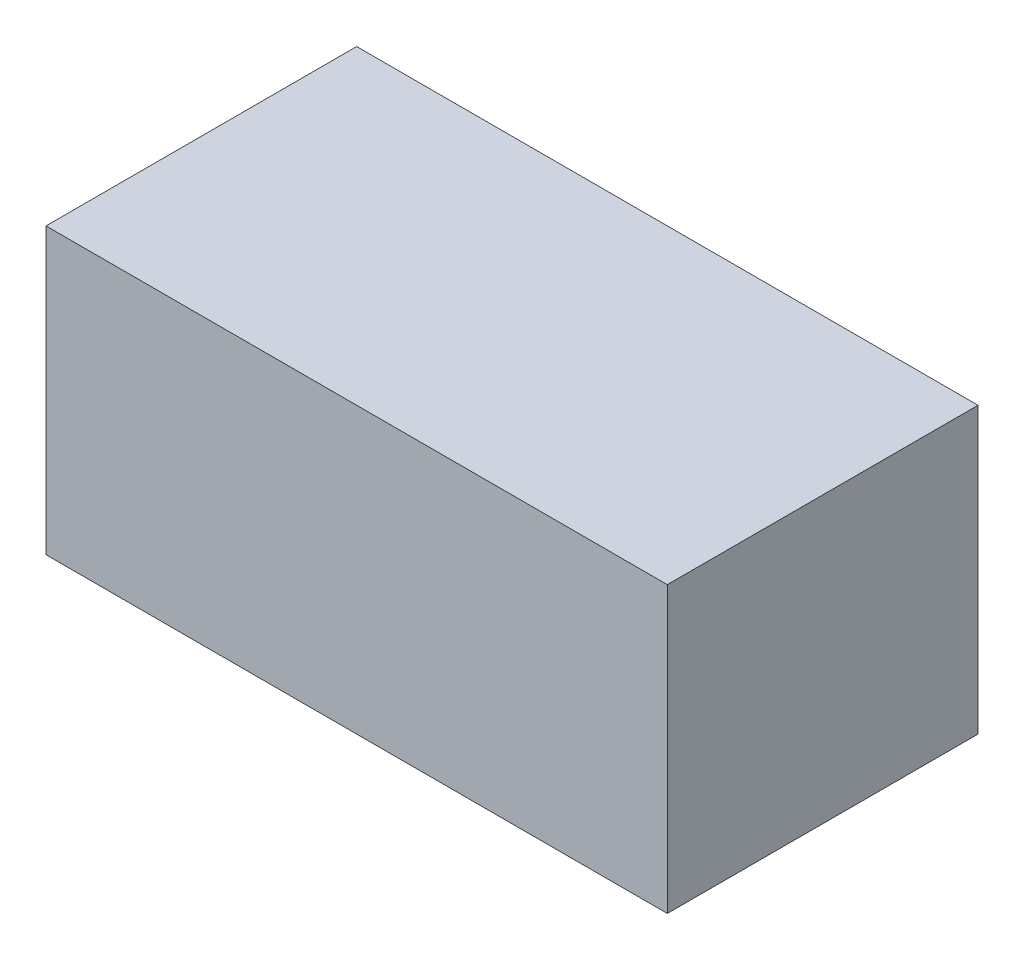
ISO-10303-21;
HEADER;
FILE_DESCRIPTION(('STEP AP214'),'2;1');
FILE_NAME('part.step','',(''),(''),'','','');
FILE_SCHEMA(('AUTOMOTIVE_DESIGN { 1 0 10303 214 1 1 1 1 }'));
ENDSEC;
DATA;
#1=APPLICATION_CONTEXT('core data for automotive mechanical design processes');
#2=APPLICATION_PROTOCOL_DEFINITION('international standard','automotive_design',2000,#1);
#3=PRODUCT_CONTEXT('',#1,'mechanical');
#4=PRODUCT('Part','Part','',(#3));
#5=PRODUCT_RELATED_PRODUCT_CATEGORY('part','',(#4));
#6=PRODUCT_DEFINITION_FORMATION('','',#4);
#7=PRODUCT_DEFINITION_CONTEXT('part definition',#1,'design');
#8=PRODUCT_DEFINITION('design','',#6,#7);
#9=PRODUCT_DEFINITION_SHAPE('','',#8);
#10=(LENGTH_UNIT() NAMED_UNIT(*) SI_UNIT(.MILLI.,.METRE.));
#11=(NAMED_UNIT(*) PLANE_ANGLE_UNIT() SI_UNIT($,.RADIAN.));
#12=(NAMED_UNIT(*) SI_UNIT($,.STERADIAN.) SOLID_ANGLE_UNIT());
#13=UNCERTAINTY_MEASURE_WITH_UNIT(LENGTH_MEASURE(1.E-05),#10,'distance_accuracy_value','');
#14=(GEOMETRIC_REPRESENTATION_CONTEXT(3) GLOBAL_UNCERTAINTY_ASSIGNED_CONTEXT((#13)) GLOBAL_UNIT_ASSIGNED_CONTEXT((#10,
#11,#12)) REPRESENTATION_CONTEXT('',''));
#15=CARTESIAN_POINT('',(0.,0.,0.));
#16=DIRECTION('',(0.,0.,1.));
#17=DIRECTION('',(1.,0.,0.));
#18=AXIS2_PLACEMENT_3D('',#15,#16,#17);
#19=CARTESIAN_POINT('',(-60.,27.5,60.));
#20=DIRECTION('',(1.,0.,0.));
#21=DIRECTION('',(0.,0.,-1.));
#22=AXIS2_PLACEMENT_3D('',#19,#20,#21);
#23=PLANE('',#22);
#24=DIRECTION('',(0.,-1.,0.));
#25=VECTOR('',#24,1.);
#26=CARTESIAN_POINT('',(-60.,27.5,0.));
#27=LINE('',#26,#25);
#28=CARTESIAN_POINT('',(-60.,27.5,0.));
#29=VERTEX_POINT('',#28);
#30=CARTESIAN_POINT('',(-60.,-27.5,0.));
#31=VERTEX_POINT('',#30);
#32=EDGE_CURVE('E104',#29,#31,#27,.T.);
#33=ORIENTED_EDGE('',*,*,#32,.T.);
#34=DIRECTION('',(0.,0.,-1.));
#35=VECTOR('',#34,1.);
#36=CARTESIAN_POINT('',(-60.,-27.5,60.));
#37=LINE('',#36,#35);
#38=CARTESIAN_POINT('',(-60.,-27.5,60.));
#39=VERTEX_POINT('',#38);
#40=EDGE_CURVE('E11',#39,#31,#37,.T.);
#41=ORIENTED_EDGE('',*,*,#40,.F.);
#42=DIRECTION('',(0.,-1.,0.));
#43=VECTOR('',#42,1.);
#44=CARTESIAN_POINT('',(-60.,27.5,60.));
#45=LINE('',#44,#43);
#46=CARTESIAN_POINT('',(-60.,27.5,60.));
#47=VERTEX_POINT('',#46);
#48=EDGE_CURVE('E92',#47,#39,#45,.T.);
#49=ORIENTED_EDGE('',*,*,#48,.F.);
#50=DIRECTION('',(0.,0.,-1.));
#51=VECTOR('',#50,1.);
#52=CARTESIAN_POINT('',(-60.,27.5,60.));
#53=LINE('',#52,#51);
#54=EDGE_CURVE('E100',#47,#29,#53,.T.);
#55=ORIENTED_EDGE('',*,*,#54,.T.);
#56=EDGE_LOOP('',(#33,#41,#49,#55));
#57=FACE_BOUND('',#56,.T.);
#58=ADVANCED_FACE('F41',(#57),#23,.F.);
#59=CARTESIAN_POINT('',(-60.,-27.5,60.));
#60=DIRECTION('',(0.,1.,0.));
#61=DIRECTION('',(-1.,0.,0.));
#62=AXIS2_PLACEMENT_3D('',#59,#60,#61);
#63=PLANE('',#62);
#64=DIRECTION('',(1.,0.,0.));
#65=VECTOR('',#64,1.);
#66=CARTESIAN_POINT('',(-60.,-27.5,0.));
#67=LINE('',#66,#65);
#68=CARTESIAN_POINT('',(60.,-27.5,0.));
#69=VERTEX_POINT('',#68);
#70=EDGE_CURVE('E96',#31,#69,#67,.T.);
#71=ORIENTED_EDGE('',*,*,#70,.T.);
#72=DIRECTION('',(0.,0.,-1.));
#73=VECTOR('',#72,1.);
#74=CARTESIAN_POINT('',(60.,-27.5,60.));
#75=LINE('',#74,#73);
#76=CARTESIAN_POINT('',(60.,-27.5,60.));
#77=VERTEX_POINT('',#76);
#78=EDGE_CURVE('E49',#77,#69,#75,.T.);
#79=ORIENTED_EDGE('',*,*,#78,.F.);
#80=DIRECTION('',(1.,0.,0.));
#81=VECTOR('',#80,1.);
#82=CARTESIAN_POINT('',(-60.,-27.5,60.));
#83=LINE('',#82,#81);
#84=EDGE_CURVE('E87',#39,#77,#83,.T.);
#85=ORIENTED_EDGE('',*,*,#84,.F.);
#86=ORIENTED_EDGE('',*,*,#40,.T.);
#87=EDGE_LOOP('',(#71,#79,#85,#86));
#88=FACE_BOUND('',#87,.T.);
#89=ADVANCED_FACE('F95',(#88),#63,.F.);
#90=CARTESIAN_POINT('',(60.,27.5,60.));
#91=DIRECTION('',(-1.,0.,0.));
#92=DIRECTION('',(0.,0.,1.));
#93=AXIS2_PLACEMENT_3D('',#90,#91,#92);
#94=PLANE('',#93);
#95=DIRECTION('',(0.,1.,0.));
#96=VECTOR('',#95,1.);
#97=CARTESIAN_POINT('',(60.,27.5,0.));
#98=LINE('',#97,#96);
#99=CARTESIAN_POINT('',(60.,27.5,0.));
#100=VERTEX_POINT('',#99);
#101=EDGE_CURVE('E74',#69,#100,#98,.T.);
#102=ORIENTED_EDGE('',*,*,#101,.T.);
#103=DIRECTION('',(0.,0.,-1.));
#104=VECTOR('',#103,1.);
#105=CARTESIAN_POINT('',(60.,27.5,60.));
#106=LINE('',#105,#104);
#107=CARTESIAN_POINT('',(60.,27.5,60.));
#108=VERTEX_POINT('',#107);
#109=EDGE_CURVE('E97',#108,#100,#106,.T.);
#110=ORIENTED_EDGE('',*,*,#109,.F.);
#111=DIRECTION('',(0.,1.,0.));
#112=VECTOR('',#111,1.);
#113=CARTESIAN_POINT('',(60.,27.5,60.));
#114=LINE('',#113,#112);
#115=EDGE_CURVE('E90',#77,#108,#114,.T.);
#116=ORIENTED_EDGE('',*,*,#115,.F.);
#117=ORIENTED_EDGE('',*,*,#78,.T.);
#118=EDGE_LOOP('',(#102,#110,#116,#117));
#119=FACE_BOUND('',#118,.T.);
#120=ADVANCED_FACE('F98',(#119),#94,.F.);
#121=CARTESIAN_POINT('',(-60.,27.5,60.));
#122=DIRECTION('',(0.,-1.,0.));
#123=DIRECTION('',(0.,0.,-1.));
#124=AXIS2_PLACEMENT_3D('',#121,#122,#123);
#125=PLANE('',#124);
#126=DIRECTION('',(-1.,0.,0.));
#127=VECTOR('',#126,1.);
#128=CARTESIAN_POINT('',(-60.,27.5,0.));
#129=LINE('',#128,#127);
#130=EDGE_CURVE('E80',#100,#29,#129,.T.);
#131=ORIENTED_EDGE('',*,*,#130,.T.);
#132=ORIENTED_EDGE('',*,*,#54,.F.);
#133=DIRECTION('',(-1.,0.,0.));
#134=VECTOR('',#133,1.);
#135=CARTESIAN_POINT('',(-60.,27.5,60.));
#136=LINE('',#135,#134);
#137=EDGE_CURVE('E57',#108,#47,#136,.T.);
#138=ORIENTED_EDGE('',*,*,#137,.F.);
#139=ORIENTED_EDGE('',*,*,#109,.T.);
#140=EDGE_LOOP('',(#131,#132,#138,#139));
#141=FACE_BOUND('',#140,.T.);
#142=ADVANCED_FACE('F111',(#141),#125,.F.);
#143=CARTESIAN_POINT('',(0.,0.,60.));
#144=DIRECTION('',(0.,0.,1.));
#145=DIRECTION('',(1.,0.,0.));
#146=AXIS2_PLACEMENT_3D('',#143,#144,#145);
#147=PLANE('',#146);
#148=ORIENTED_EDGE('',*,*,#48,.T.);
#149=ORIENTED_EDGE('',*,*,#84,.T.);
#150=ORIENTED_EDGE('',*,*,#115,.T.);
#151=ORIENTED_EDGE('',*,*,#137,.T.);
#152=EDGE_LOOP('',(#148,#149,#150,#151));
#153=FACE_BOUND('',#152,.T.);
#154=ADVANCED_FACE('F88',(#153),#147,.T.);
#155=CARTESIAN_POINT('',(0.,0.,0.));
#156=DIRECTION('',(0.,0.,1.));
#157=DIRECTION('',(1.,0.,0.));
#158=AXIS2_PLACEMENT_3D('',#155,#156,#157);
#159=PLANE('',#158);
#160=ORIENTED_EDGE('',*,*,#32,.F.);
#161=ORIENTED_EDGE('',*,*,#130,.F.);
#162=ORIENTED_EDGE('',*,*,#101,.F.);
#163=ORIENTED_EDGE('',*,*,#70,.F.);
#164=EDGE_LOOP('',(#160,#161,#162,#163));
#165=FACE_BOUND('',#164,.T.);
#166=ADVANCED_FACE('F114',(#165),#159,.F.);
#167=CLOSED_SHELL('',(#58,#89,#120,#142,#154,#166));
#168=MANIFOLD_SOLID_BREP('B2',#167);
#169=ADVANCED_BREP_SHAPE_REPRESENTATION('',(#18,#168),#14);
#170=SHAPE_DEFINITION_REPRESENTATION(#9,#169);
ENDSEC;
END-ISO-10303-21;
